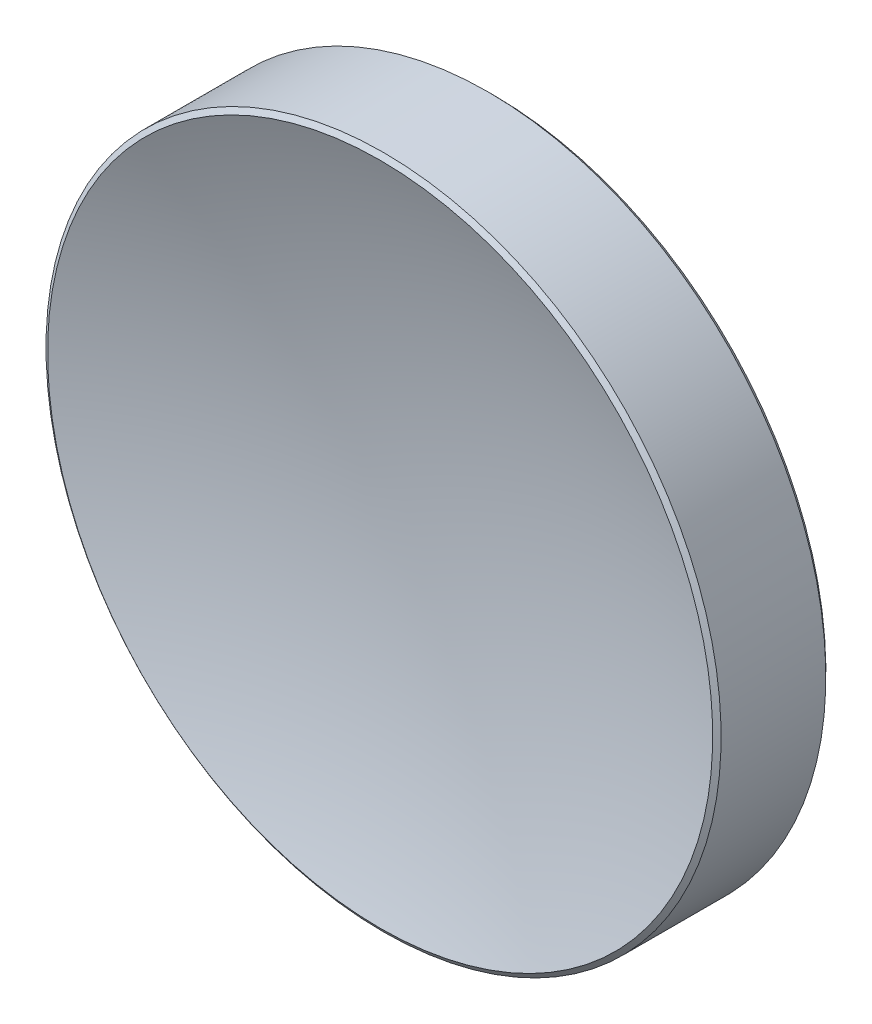
ISO-10303-21;
HEADER;
FILE_DESCRIPTION(('STEP AP214'),'2;1');
FILE_NAME('part.step','',(''),(''),'','','');
FILE_SCHEMA(('AUTOMOTIVE_DESIGN { 1 0 10303 214 1 1 1 1 }'));
ENDSEC;
DATA;
#1=APPLICATION_CONTEXT('core data for automotive mechanical design processes');
#2=APPLICATION_PROTOCOL_DEFINITION('international standard','automotive_design',2000,#1);
#3=PRODUCT_CONTEXT('',#1,'mechanical');
#4=PRODUCT('Part','Part','',(#3));
#5=PRODUCT_RELATED_PRODUCT_CATEGORY('part','',(#4));
#6=PRODUCT_DEFINITION_FORMATION('','',#4);
#7=PRODUCT_DEFINITION_CONTEXT('part definition',#1,'design');
#8=PRODUCT_DEFINITION('design','',#6,#7);
#9=PRODUCT_DEFINITION_SHAPE('','',#8);
#10=(LENGTH_UNIT() NAMED_UNIT(*) SI_UNIT(.MILLI.,.METRE.));
#11=(NAMED_UNIT(*) PLANE_ANGLE_UNIT() SI_UNIT($,.RADIAN.));
#12=(NAMED_UNIT(*) SI_UNIT($,.STERADIAN.) SOLID_ANGLE_UNIT());
#13=UNCERTAINTY_MEASURE_WITH_UNIT(LENGTH_MEASURE(1.E-05),#10,'distance_accuracy_value','');
#14=(GEOMETRIC_REPRESENTATION_CONTEXT(3) GLOBAL_UNCERTAINTY_ASSIGNED_CONTEXT((#13)) GLOBAL_UNIT_ASSIGNED_CONTEXT((#10,
#11,#12)) REPRESENTATION_CONTEXT('',''));
#15=CARTESIAN_POINT('',(0.,0.,0.));
#16=DIRECTION('',(0.,0.,1.));
#17=DIRECTION('',(1.,0.,0.));
#18=AXIS2_PLACEMENT_3D('',#15,#16,#17);
#19=CARTESIAN_POINT('',(0.,0.,-2.17019947247625));
#20=DIRECTION('',(0.,0.,-1.));
#21=DIRECTION('',(0.,1.,0.));
#22=AXIS2_PLACEMENT_3D('',#19,#20,#21);
#23=PLANE('',#22);
#24=CARTESIAN_POINT('',(0.,0.,-2.17019947247625));
#25=DIRECTION('',(0.,0.,-1.));
#26=DIRECTION('',(0.,1.,0.));
#27=AXIS2_PLACEMENT_3D('',#24,#25,#26);
#28=CIRCLE('',#27,12.5);
#29=CARTESIAN_POINT('',(0.,12.5,-2.17019947247625));
#30=VERTEX_POINT('',#29);
#31=EDGE_CURVE('E28',#30,#30,#28,.T.);
#32=ORIENTED_EDGE('',*,*,#31,.T.);
#33=EDGE_LOOP('',(#32));
#34=FACE_BOUND('',#33,.T.);
#35=ADVANCED_FACE('F13',(#34),#23,.T.);
#36=CARTESIAN_POINT('',(0.,0.,-2.17019947247625));
#37=DIRECTION('',(0.,0.,-1.));
#38=DIRECTION('',(0.,1.,0.));
#39=AXIS2_PLACEMENT_3D('',#36,#37,#38);
#40=CYLINDRICAL_SURFACE('',#39,12.7);
#41=CARTESIAN_POINT('',(0.,0.,-1.97019947247626));
#42=DIRECTION('',(0.,0.,-1.));
#43=DIRECTION('',(0.,1.,0.));
#44=AXIS2_PLACEMENT_3D('',#41,#42,#43);
#45=CIRCLE('',#44,12.7);
#46=CARTESIAN_POINT('',(0.,12.7,-1.97019947247625));
#47=VERTEX_POINT('',#46);
#48=EDGE_CURVE('E20',#47,#47,#45,.F.);
#49=ORIENTED_EDGE('',*,*,#48,.T.);
#50=EDGE_LOOP('',(#49));
#51=FACE_BOUND('',#50,.T.);
#52=CARTESIAN_POINT('',(0.,0.,1.97019947247623));
#53=DIRECTION('',(0.,0.,1.));
#54=DIRECTION('',(0.,-1.,0.));
#55=AXIS2_PLACEMENT_3D('',#52,#53,#54);
#56=CIRCLE('',#55,12.7);
#57=CARTESIAN_POINT('',(0.,-12.7,1.97019947247622));
#58=VERTEX_POINT('',#57);
#59=EDGE_CURVE('E24',#58,#58,#56,.F.);
#60=ORIENTED_EDGE('',*,*,#59,.T.);
#61=EDGE_LOOP('',(#60));
#62=FACE_BOUND('',#61,.T.);
#63=ADVANCED_FACE('F45',(#51,#62),#40,.T.);
#64=CARTESIAN_POINT('',(0.,0.,35.4578005275238));
#65=DIRECTION('',(0.,0.,-1.));
#66=DIRECTION('',(0.,1.,0.));
#67=AXIS2_PLACEMENT_3D('',#64,#65,#66);
#68=SPHERICAL_SURFACE('',#67,35.628);
#69=CARTESIAN_POINT('',(0.,0.,2.09929538952796));
#70=DIRECTION('',(0.,0.,1.));
#71=DIRECTION('',(0.,-1.,0.));
#72=AXIS2_PLACEMENT_3D('',#69,#70,#71);
#73=CIRCLE('',#72,12.512574433677);
#74=CARTESIAN_POINT('',(0.,-12.512574433677,2.09929538952796));
#75=VERTEX_POINT('',#74);
#76=EDGE_CURVE('E9',#75,#75,#73,.T.);
#77=ORIENTED_EDGE('',*,*,#76,.T.);
#78=EDGE_LOOP('',(#77));
#79=FACE_BOUND('',#78,.T.);
#80=ADVANCED_FACE('F37',(#79),#68,.F.);
#81=CARTESIAN_POINT('',(0.,0.,-2.17019947247625));
#82=DIRECTION('',(0.,0.,1.));
#83=DIRECTION('',(0.,-1.,0.));
#84=AXIS2_PLACEMENT_3D('',#81,#82,#83);
#85=CONICAL_SURFACE('',#84,12.5,0.785398163397448);
#86=ORIENTED_EDGE('',*,*,#48,.F.);
#87=EDGE_LOOP('',(#86));
#88=FACE_BOUND('',#87,.T.);
#89=ORIENTED_EDGE('',*,*,#31,.F.);
#90=EDGE_LOOP('',(#89));
#91=FACE_BOUND('',#90,.T.);
#92=ADVANCED_FACE('F35',(#88,#91),#85,.T.);
#93=CARTESIAN_POINT('',(0.,0.,1.97019947247623));
#94=DIRECTION('',(0.,0.,-1.));
#95=DIRECTION('',(0.,1.,0.));
#96=AXIS2_PLACEMENT_3D('',#93,#94,#95);
#97=CONICAL_SURFACE('',#96,12.7,0.967636937037752);
#98=ORIENTED_EDGE('',*,*,#76,.F.);
#99=EDGE_LOOP('',(#98));
#100=FACE_BOUND('',#99,.T.);
#101=ORIENTED_EDGE('',*,*,#59,.F.);
#102=EDGE_LOOP('',(#101));
#103=FACE_BOUND('',#102,.T.);
#104=ADVANCED_FACE('F15',(#100,#103),#97,.T.);
#105=CLOSED_SHELL('',(#35,#63,#80,#92,#104));
#106=MANIFOLD_SOLID_BREP('B1',#105);
#107=ADVANCED_BREP_SHAPE_REPRESENTATION('',(#18,#106),#14);
#108=SHAPE_DEFINITION_REPRESENTATION(#9,#107);
ENDSEC;
END-ISO-10303-21;
